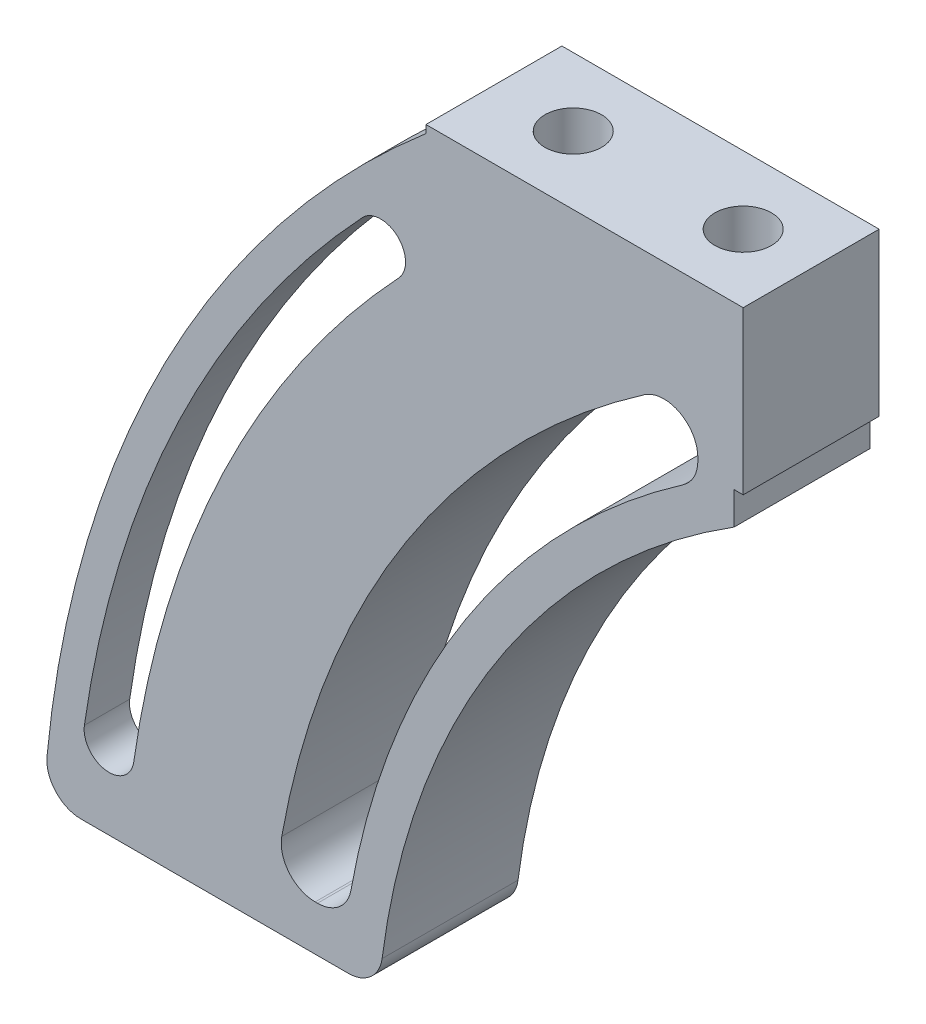
ISO-10303-21;
HEADER;
FILE_DESCRIPTION(('STEP AP214'),'2;1');
FILE_NAME('part.step','',(''),(''),'','','');
FILE_SCHEMA(('AUTOMOTIVE_DESIGN { 1 0 10303 214 1 1 1 1 }'));
ENDSEC;
DATA;
#1=APPLICATION_CONTEXT('core data for automotive mechanical design processes');
#2=APPLICATION_PROTOCOL_DEFINITION('international standard','automotive_design',2000,#1);
#3=PRODUCT_CONTEXT('',#1,'mechanical');
#4=PRODUCT('Part','Part','',(#3));
#5=PRODUCT_RELATED_PRODUCT_CATEGORY('part','',(#4));
#6=PRODUCT_DEFINITION_FORMATION('','',#4);
#7=PRODUCT_DEFINITION_CONTEXT('part definition',#1,'design');
#8=PRODUCT_DEFINITION('design','',#6,#7);
#9=PRODUCT_DEFINITION_SHAPE('','',#8);
#10=(LENGTH_UNIT() NAMED_UNIT(*) SI_UNIT(.MILLI.,.METRE.));
#11=(NAMED_UNIT(*) PLANE_ANGLE_UNIT() SI_UNIT($,.RADIAN.));
#12=(NAMED_UNIT(*) SI_UNIT($,.STERADIAN.) SOLID_ANGLE_UNIT());
#13=UNCERTAINTY_MEASURE_WITH_UNIT(LENGTH_MEASURE(1.E-05),#10,'distance_accuracy_value','');
#14=(GEOMETRIC_REPRESENTATION_CONTEXT(3) GLOBAL_UNCERTAINTY_ASSIGNED_CONTEXT((#13)) GLOBAL_UNIT_ASSIGNED_CONTEXT((#10,
#11,#12)) REPRESENTATION_CONTEXT('',''));
#15=CARTESIAN_POINT('',(0.,0.,0.));
#16=DIRECTION('',(0.,0.,1.));
#17=DIRECTION('',(1.,0.,0.));
#18=AXIS2_PLACEMENT_3D('',#15,#16,#17);
#19=CARTESIAN_POINT('',(-31.5,0.,-3.));
#20=DIRECTION('',(-1.,0.,0.));
#21=DIRECTION('',(0.,0.,1.));
#22=AXIS2_PLACEMENT_3D('',#19,#20,#21);
#23=PLANE('',#22);
#24=DIRECTION('',(0.,-1.,0.));
#25=VECTOR('',#24,1.);
#26=CARTESIAN_POINT('',(-31.5,0.,-3.));
#27=LINE('',#26,#25);
#28=CARTESIAN_POINT('',(-31.5,-2.5,-3.));
#29=VERTEX_POINT('',#28);
#30=CARTESIAN_POINT('',(-31.5,-12.4837006040881,-3.));
#31=VERTEX_POINT('',#30);
#32=EDGE_CURVE('E385',#29,#31,#27,.T.);
#33=ORIENTED_EDGE('',*,*,#32,.T.);
#34=DIRECTION('',(0.,0.,-1.));
#35=VECTOR('',#34,1.);
#36=CARTESIAN_POINT('',(-31.5,-12.4837006040881,1.));
#37=LINE('',#36,#35);
#38=CARTESIAN_POINT('',(-31.5,-12.4837006040881,1.));
#39=VERTEX_POINT('',#38);
#40=EDGE_CURVE('E501',#31,#39,#37,.F.);
#41=ORIENTED_EDGE('',*,*,#40,.T.);
#42=DIRECTION('',(0.,-1.,0.));
#43=VECTOR('',#42,1.);
#44=CARTESIAN_POINT('',(-31.5,-2.84659798601669,1.));
#45=LINE('',#44,#43);
#46=CARTESIAN_POINT('',(-31.5,-2.84659798601669,1.));
#47=VERTEX_POINT('',#46);
#48=EDGE_CURVE('E283',#47,#39,#45,.T.);
#49=ORIENTED_EDGE('',*,*,#48,.F.);
#50=DIRECTION('',(0.,0.,1.));
#51=VECTOR('',#50,1.);
#52=CARTESIAN_POINT('',(-31.5,-2.84659798601669,1.));
#53=LINE('',#52,#51);
#54=CARTESIAN_POINT('',(-31.5,-2.84659798601669,3.));
#55=VERTEX_POINT('',#54);
#56=EDGE_CURVE('E287',#47,#55,#53,.T.);
#57=ORIENTED_EDGE('',*,*,#56,.T.);
#58=DIRECTION('',(0.,-1.,0.));
#59=VECTOR('',#58,1.);
#60=CARTESIAN_POINT('',(-31.5,0.,3.));
#61=LINE('',#60,#59);
#62=CARTESIAN_POINT('',(-31.5,-2.5,3.));
#63=VERTEX_POINT('',#62);
#64=EDGE_CURVE('E350',#63,#55,#61,.T.);
#65=ORIENTED_EDGE('',*,*,#64,.F.);
#66=DIRECTION('',(0.,0.,1.));
#67=VECTOR('',#66,1.);
#68=CARTESIAN_POINT('',(-31.5,-2.5,-3.));
#69=LINE('',#68,#67);
#70=EDGE_CURVE('E407',#29,#63,#69,.T.);
#71=ORIENTED_EDGE('',*,*,#70,.F.);
#72=EDGE_LOOP('',(#33,#41,#49,#57,#65,#71));
#73=FACE_BOUND('',#72,.T.);
#74=ADVANCED_FACE('F45',(#73),#23,.T.);
#75=CARTESIAN_POINT('',(0.,-2.5,-3.));
#76=DIRECTION('',(0.,1.,0.));
#77=DIRECTION('',(0.,0.,1.));
#78=AXIS2_PLACEMENT_3D('',#75,#76,#77);
#79=PLANE('',#78);
#80=CARTESIAN_POINT('',(-20.5,-2.5,0.));
#81=DIRECTION('',(0.,1.,0.));
#82=DIRECTION('',(0.,0.,1.));
#83=AXIS2_PLACEMENT_3D('',#80,#81,#82);
#84=CIRCLE('',#83,1.24999999999999);
#85=CARTESIAN_POINT('',(-20.5,-2.5,1.24999999999998));
#86=VERTEX_POINT('',#85);
#87=EDGE_CURVE('E313',#86,#86,#84,.T.);
#88=ORIENTED_EDGE('',*,*,#87,.F.);
#89=EDGE_LOOP('',(#88));
#90=FACE_BOUND('',#89,.T.);
#91=CARTESIAN_POINT('',(-28.,-2.5,0.));
#92=DIRECTION('',(0.,1.,0.));
#93=DIRECTION('',(0.,0.,1.));
#94=AXIS2_PLACEMENT_3D('',#91,#92,#93);
#95=CIRCLE('',#94,1.24999999999999);
#96=CARTESIAN_POINT('',(-28.,-2.5,1.24999999999999));
#97=VERTEX_POINT('',#96);
#98=EDGE_CURVE('E326',#97,#97,#95,.T.);
#99=ORIENTED_EDGE('',*,*,#98,.F.);
#100=EDGE_LOOP('',(#99));
#101=FACE_BOUND('',#100,.T.);
#102=ORIENTED_EDGE('',*,*,#70,.T.);
#103=DIRECTION('',(-1.,0.,0.));
#104=VECTOR('',#103,1.);
#105=CARTESIAN_POINT('',(0.,-2.5,3.));
#106=LINE('',#105,#104);
#107=CARTESIAN_POINT('',(-17.5,-2.5,3.));
#108=VERTEX_POINT('',#107);
#109=EDGE_CURVE('E365',#108,#63,#106,.T.);
#110=ORIENTED_EDGE('',*,*,#109,.F.);
#111=DIRECTION('',(0.,0.,1.));
#112=VECTOR('',#111,1.);
#113=CARTESIAN_POINT('',(-17.5,-2.5,-3.));
#114=LINE('',#113,#112);
#115=CARTESIAN_POINT('',(-17.5,-2.5,-3.));
#116=VERTEX_POINT('',#115);
#117=EDGE_CURVE('E406',#116,#108,#114,.T.);
#118=ORIENTED_EDGE('',*,*,#117,.F.);
#119=DIRECTION('',(-1.,0.,0.));
#120=VECTOR('',#119,1.);
#121=CARTESIAN_POINT('',(0.,-2.5,-3.));
#122=LINE('',#121,#120);
#123=EDGE_CURVE('E402',#116,#29,#122,.T.);
#124=ORIENTED_EDGE('',*,*,#123,.T.);
#125=EDGE_LOOP('',(#102,#110,#118,#124));
#126=FACE_BOUND('',#125,.T.);
#127=ADVANCED_FACE('F555',(#90,#101,#126),#79,.T.);
#128=CARTESIAN_POINT('',(-17.5,0.,-3.));
#129=DIRECTION('',(-1.,0.,0.));
#130=DIRECTION('',(0.,0.,1.));
#131=AXIS2_PLACEMENT_3D('',#128,#129,#130);
#132=PLANE('',#131);
#133=DIRECTION('',(0.,-1.,0.));
#134=VECTOR('',#133,1.);
#135=CARTESIAN_POINT('',(-17.5,0.,3.));
#136=LINE('',#135,#134);
#137=CARTESIAN_POINT('',(-17.5,-9.65278175968161,3.));
#138=VERTEX_POINT('',#137);
#139=EDGE_CURVE('E361',#108,#138,#136,.T.);
#140=ORIENTED_EDGE('',*,*,#139,.T.);
#141=DIRECTION('',(0.,0.,1.));
#142=VECTOR('',#141,1.);
#143=CARTESIAN_POINT('',(-17.5,-9.65278175968161,-3.));
#144=LINE('',#143,#142);
#145=CARTESIAN_POINT('',(-17.5,-9.65278175968161,-3.));
#146=VERTEX_POINT('',#145);
#147=EDGE_CURVE('E303',#146,#138,#144,.T.);
#148=ORIENTED_EDGE('',*,*,#147,.F.);
#149=DIRECTION('',(0.,-1.,0.));
#150=VECTOR('',#149,1.);
#151=CARTESIAN_POINT('',(-17.5,0.,-3.));
#152=LINE('',#151,#150);
#153=EDGE_CURVE('E398',#116,#146,#152,.T.);
#154=ORIENTED_EDGE('',*,*,#153,.F.);
#155=ORIENTED_EDGE('',*,*,#117,.T.);
#156=EDGE_LOOP('',(#140,#148,#154,#155));
#157=FACE_BOUND('',#156,.T.);
#158=ADVANCED_FACE('F559',(#157),#132,.F.);
#159=CARTESIAN_POINT('',(0.,-39.6527817596816,-3.));
#160=DIRECTION('',(0.,0.,1.));
#161=DIRECTION('',(1.,0.,0.));
#162=AXIS2_PLACEMENT_3D('',#159,#160,#161);
#163=CYLINDRICAL_SURFACE('',#162,33.7120156620751);
#164=CARTESIAN_POINT('',(0.,-39.6527817596816,3.));
#165=DIRECTION('',(0.,0.,1.));
#166=DIRECTION('',(1.,0.,0.));
#167=AXIS2_PLACEMENT_3D('',#164,#165,#166);
#168=CIRCLE('',#167,33.7120156620751);
#169=CARTESIAN_POINT('',(-17.9,-11.0854927738503,3.));
#170=VERTEX_POINT('',#169);
#171=CARTESIAN_POINT('',(-33.4355875680168,-35.3444776871394,3.));
#172=VERTEX_POINT('',#171);
#173=EDGE_CURVE('E358',#170,#172,#168,.T.);
#174=ORIENTED_EDGE('',*,*,#173,.T.);
#175=DIRECTION('',(0.,0.,1.));
#176=VECTOR('',#175,1.);
#177=CARTESIAN_POINT('',(-33.4355875680168,-35.3444776871394,-3.));
#178=LINE('',#177,#176);
#179=CARTESIAN_POINT('',(-33.4355875680168,-35.3444776871394,-3.));
#180=VERTEX_POINT('',#179);
#181=EDGE_CURVE('E61',#172,#180,#178,.F.);
#182=ORIENTED_EDGE('',*,*,#181,.T.);
#183=CARTESIAN_POINT('',(0.,-39.6527817596816,-3.));
#184=DIRECTION('',(0.,0.,1.));
#185=DIRECTION('',(1.,0.,0.));
#186=AXIS2_PLACEMENT_3D('',#183,#184,#185);
#187=CIRCLE('',#186,33.7120156620751);
#188=CARTESIAN_POINT('',(-17.9,-11.0854927738503,-3.));
#189=VERTEX_POINT('',#188);
#190=EDGE_CURVE('E395',#189,#180,#187,.T.);
#191=ORIENTED_EDGE('',*,*,#190,.F.);
#192=DIRECTION('',(0.,0.,1.));
#193=VECTOR('',#192,1.);
#194=CARTESIAN_POINT('',(-17.9,-11.0854927738503,-3.));
#195=LINE('',#194,#193);
#196=EDGE_CURVE('E309',#189,#170,#195,.T.);
#197=ORIENTED_EDGE('',*,*,#196,.T.);
#198=EDGE_LOOP('',(#174,#182,#191,#197));
#199=FACE_BOUND('',#198,.T.);
#200=ADVANCED_FACE('F567',(#199),#163,.F.);
#201=CARTESIAN_POINT('',(0.,-36.6527817596816,-3.));
#202=DIRECTION('',(0.,1.,0.));
#203=DIRECTION('',(-1.,0.,0.));
#204=AXIS2_PLACEMENT_3D('',#201,#202,#203);
#205=PLANE('',#204);
#206=DIRECTION('',(-1.,0.,0.));
#207=VECTOR('',#206,1.);
#208=CARTESIAN_POINT('',(0.,-36.6527817596816,3.));
#209=LINE('',#208,#207);
#210=CARTESIAN_POINT('',(-34.9232880322891,-36.6527817596816,3.));
#211=VERTEX_POINT('',#210);
#212=CARTESIAN_POINT('',(-46.729105744497,-36.6527817596816,3.));
#213=VERTEX_POINT('',#212);
#214=EDGE_CURVE('E354',#211,#213,#209,.T.);
#215=ORIENTED_EDGE('',*,*,#214,.T.);
#216=DIRECTION('',(0.,0.,1.));
#217=VECTOR('',#216,1.);
#218=CARTESIAN_POINT('',(-46.729105744497,-36.6527817596816,-3.));
#219=LINE('',#218,#217);
#220=CARTESIAN_POINT('',(-46.729105744497,-36.6527817596816,1.));
#221=VERTEX_POINT('',#220);
#222=EDGE_CURVE('E492',#213,#221,#219,.F.);
#223=ORIENTED_EDGE('',*,*,#222,.T.);
#224=DIRECTION('',(-1.,0.,0.));
#225=VECTOR('',#224,1.);
#226=CARTESIAN_POINT('',(-41.1360320222893,-36.6527817596816,1.));
#227=LINE('',#226,#225);
#228=CARTESIAN_POINT('',(-39.4897111946694,-36.6527817596816,1.));
#229=VERTEX_POINT('',#228);
#230=EDGE_CURVE('E276',#229,#221,#227,.T.);
#231=ORIENTED_EDGE('',*,*,#230,.F.);
#232=DIRECTION('',(0.,0.,-1.));
#233=VECTOR('',#232,1.);
#234=CARTESIAN_POINT('',(-39.4897111946694,-36.6527817596816,-3.));
#235=LINE('',#234,#233);
#236=CARTESIAN_POINT('',(-39.4897111946694,-36.6527817596816,-3.));
#237=VERTEX_POINT('',#236);
#238=EDGE_CURVE('E485',#229,#237,#235,.T.);
#239=ORIENTED_EDGE('',*,*,#238,.T.);
#240=DIRECTION('',(-1.,0.,0.));
#241=VECTOR('',#240,1.);
#242=CARTESIAN_POINT('',(0.,-36.6527817596816,-3.));
#243=LINE('',#242,#241);
#244=CARTESIAN_POINT('',(-34.9232880322891,-36.6527817596816,-3.));
#245=VERTEX_POINT('',#244);
#246=EDGE_CURVE('E392',#245,#237,#243,.T.);
#247=ORIENTED_EDGE('',*,*,#246,.F.);
#248=DIRECTION('',(0.,0.,1.));
#249=VECTOR('',#248,1.);
#250=CARTESIAN_POINT('',(-34.9232880322891,-36.6527817596816,-3.));
#251=LINE('',#250,#249);
#252=EDGE_CURVE('E488',#245,#211,#251,.T.);
#253=ORIENTED_EDGE('',*,*,#252,.T.);
#254=EDGE_LOOP('',(#215,#223,#231,#239,#247,#253));
#255=FACE_BOUND('',#254,.T.);
#256=ADVANCED_FACE('F573',(#255),#205,.F.);
#257=CARTESIAN_POINT('',(-19.5,0.,-3.));
#258=DIRECTION('',(-1.,0.,0.));
#259=DIRECTION('',(0.,-1.,0.));
#260=AXIS2_PLACEMENT_3D('',#257,#258,#259);
#261=PLANE('',#260);
#262=DIRECTION('',(0.,-1.,0.));
#263=VECTOR('',#262,1.);
#264=CARTESIAN_POINT('',(-19.5,0.,-3.));
#265=LINE('',#264,#263);
#266=CARTESIAN_POINT('',(-19.5,-9.23535731012383,-3.));
#267=VERTEX_POINT('',#266);
#268=CARTESIAN_POINT('',(-19.5,-9.35695319764157,-3.));
#269=VERTEX_POINT('',#268);
#270=EDGE_CURVE('E369',#267,#269,#265,.T.);
#271=ORIENTED_EDGE('',*,*,#270,.T.);
#272=DIRECTION('',(0.,0.,-1.));
#273=VECTOR('',#272,1.);
#274=CARTESIAN_POINT('',(-19.5,-9.35695319764157,3.));
#275=LINE('',#274,#273);
#276=CARTESIAN_POINT('',(-19.5,-9.35695319764157,3.));
#277=VERTEX_POINT('',#276);
#278=EDGE_CURVE('E436',#269,#277,#275,.F.);
#279=ORIENTED_EDGE('',*,*,#278,.T.);
#280=DIRECTION('',(0.,-1.,0.));
#281=VECTOR('',#280,1.);
#282=CARTESIAN_POINT('',(-19.5,0.,3.));
#283=LINE('',#282,#281);
#284=CARTESIAN_POINT('',(-19.5,-9.23535731012383,3.));
#285=VERTEX_POINT('',#284);
#286=EDGE_CURVE('E334',#285,#277,#283,.T.);
#287=ORIENTED_EDGE('',*,*,#286,.F.);
#288=DIRECTION('',(0.,0.,1.));
#289=VECTOR('',#288,1.);
#290=CARTESIAN_POINT('',(-19.5,-9.23535731012383,-3.));
#291=LINE('',#290,#289);
#292=EDGE_CURVE('E433',#285,#267,#291,.F.);
#293=ORIENTED_EDGE('',*,*,#292,.T.);
#294=EDGE_LOOP('',(#271,#279,#287,#293));
#295=FACE_BOUND('',#294,.T.);
#296=ADVANCED_FACE('F575',(#295),#261,.T.);
#297=CARTESIAN_POINT('',(0.,-39.6527817596816,-3.));
#298=DIRECTION('',(0.,0.,1.));
#299=DIRECTION('',(1.,0.,0.));
#300=AXIS2_PLACEMENT_3D('',#297,#298,#299);
#301=CYLINDRICAL_SURFACE('',#300,38.4624094201738);
#302=CARTESIAN_POINT('',(0.,-39.6527817596816,3.));
#303=DIRECTION('',(0.,0.,1.));
#304=DIRECTION('',(1.,0.,0.));
#305=AXIS2_PLACEMENT_3D('',#302,#303,#304);
#306=CIRCLE('',#305,38.4624094201738);
#307=CARTESIAN_POINT('',(-21.8522171712867,-8.00096438525584,3.));
#308=VERTEX_POINT('',#307);
#309=CARTESIAN_POINT('',(-37.8630188726719,-32.8890002542834,3.));
#310=VERTEX_POINT('',#309);
#311=EDGE_CURVE('E346',#308,#310,#306,.T.);
#312=ORIENTED_EDGE('',*,*,#311,.T.);
#313=DIRECTION('',(0.,0.,1.));
#314=VECTOR('',#313,1.);
#315=CARTESIAN_POINT('',(-37.8630188726719,-32.8890002542834,-3.));
#316=LINE('',#315,#314);
#317=CARTESIAN_POINT('',(-37.8630188726719,-32.8890002542834,-3.));
#318=VERTEX_POINT('',#317);
#319=EDGE_CURVE('E423',#310,#318,#316,.F.);
#320=ORIENTED_EDGE('',*,*,#319,.T.);
#321=CARTESIAN_POINT('',(0.,-39.6527817596816,-3.));
#322=DIRECTION('',(0.,0.,1.));
#323=DIRECTION('',(1.,0.,0.));
#324=AXIS2_PLACEMENT_3D('',#321,#322,#323);
#325=CIRCLE('',#324,38.4624094201738);
#326=CARTESIAN_POINT('',(-21.8522171712867,-8.00096438525584,-3.));
#327=VERTEX_POINT('',#326);
#328=EDGE_CURVE('E381',#327,#318,#325,.T.);
#329=ORIENTED_EDGE('',*,*,#328,.F.);
#330=DIRECTION('',(0.,0.,1.));
#331=VECTOR('',#330,1.);
#332=CARTESIAN_POINT('',(-21.8522171712867,-8.00096438525583,-3.));
#333=LINE('',#332,#331);
#334=EDGE_CURVE('E419',#327,#308,#333,.T.);
#335=ORIENTED_EDGE('',*,*,#334,.T.);
#336=EDGE_LOOP('',(#312,#320,#329,#335));
#337=FACE_BOUND('',#336,.T.);
#338=ADVANCED_FACE('F581',(#337),#301,.F.);
#339=CARTESIAN_POINT('',(0.,-34.6527817596816,-3.));
#340=DIRECTION('',(0.,-1.,0.));
#341=DIRECTION('',(0.,0.,-1.));
#342=AXIS2_PLACEMENT_3D('',#339,#340,#341);
#343=PLANE('',#342);
#344=DIRECTION('',(1.,0.,0.));
#345=VECTOR('',#344,1.);
#346=CARTESIAN_POINT('',(0.,-34.6527817596816,-3.));
#347=LINE('',#346,#345);
#348=CARTESIAN_POINT('',(-36.3863945746835,-34.6527817596816,-3.));
#349=VERTEX_POINT('',#348);
#350=CARTESIAN_POINT('',(-36.2848071272333,-34.6527817596816,-3.));
#351=VERTEX_POINT('',#350);
#352=EDGE_CURVE('E377',#349,#351,#347,.T.);
#353=ORIENTED_EDGE('',*,*,#352,.F.);
#354=DIRECTION('',(0.,0.,-1.));
#355=VECTOR('',#354,1.);
#356=CARTESIAN_POINT('',(-36.3863945746835,-34.6527817596816,3.));
#357=LINE('',#356,#355);
#358=CARTESIAN_POINT('',(-36.3863945746835,-34.6527817596816,3.));
#359=VERTEX_POINT('',#358);
#360=EDGE_CURVE('E415',#349,#359,#357,.F.);
#361=ORIENTED_EDGE('',*,*,#360,.T.);
#362=DIRECTION('',(1.,0.,0.));
#363=VECTOR('',#362,1.);
#364=CARTESIAN_POINT('',(0.,-34.6527817596816,3.));
#365=LINE('',#364,#363);
#366=CARTESIAN_POINT('',(-36.2848071272333,-34.6527817596816,3.));
#367=VERTEX_POINT('',#366);
#368=EDGE_CURVE('E342',#359,#367,#365,.T.);
#369=ORIENTED_EDGE('',*,*,#368,.T.);
#370=DIRECTION('',(0.,0.,1.));
#371=VECTOR('',#370,1.);
#372=CARTESIAN_POINT('',(-36.2848071272333,-34.6527817596816,-3.));
#373=LINE('',#372,#371);
#374=EDGE_CURVE('E410',#367,#351,#373,.F.);
#375=ORIENTED_EDGE('',*,*,#374,.T.);
#376=EDGE_LOOP('',(#353,#361,#369,#375));
#377=FACE_BOUND('',#376,.T.);
#378=ADVANCED_FACE('F596',(#377),#343,.F.);
#379=CARTESIAN_POINT('',(0.,-39.6527817596816,-3.));
#380=DIRECTION('',(0.,0.,1.));
#381=DIRECTION('',(1.,0.,0.));
#382=AXIS2_PLACEMENT_3D('',#379,#380,#381);
#383=CYLINDRICAL_SURFACE('',#382,35.3624094201739);
#384=CARTESIAN_POINT('',(0.,-39.6527817596816,-3.));
#385=DIRECTION('',(0.,0.,1.));
#386=DIRECTION('',(1.,0.,0.));
#387=AXIS2_PLACEMENT_3D('',#384,#385,#386);
#388=CIRCLE('',#387,35.3624094201739);
#389=CARTESIAN_POINT('',(-20.1454709419303,-10.5897468092873,-3.));
#390=VERTEX_POINT('',#389);
#391=CARTESIAN_POINT('',(-34.8083108388202,-33.4172788490841,-3.));
#392=VERTEX_POINT('',#391);
#393=EDGE_CURVE('E373',#390,#392,#388,.T.);
#394=ORIENTED_EDGE('',*,*,#393,.T.);
#395=DIRECTION('',(0.,0.,1.));
#396=VECTOR('',#395,1.);
#397=CARTESIAN_POINT('',(-34.8083108388202,-33.4172788490841,-3.));
#398=LINE('',#397,#396);
#399=CARTESIAN_POINT('',(-34.8083108388202,-33.4172788490841,3.));
#400=VERTEX_POINT('',#399);
#401=EDGE_CURVE('E429',#392,#400,#398,.T.);
#402=ORIENTED_EDGE('',*,*,#401,.T.);
#403=CARTESIAN_POINT('',(0.,-39.6527817596816,3.));
#404=DIRECTION('',(0.,0.,1.));
#405=DIRECTION('',(1.,0.,0.));
#406=AXIS2_PLACEMENT_3D('',#403,#404,#405);
#407=CIRCLE('',#406,35.3624094201739);
#408=CARTESIAN_POINT('',(-20.1454709419303,-10.5897468092873,3.));
#409=VERTEX_POINT('',#408);
#410=EDGE_CURVE('E338',#409,#400,#407,.T.);
#411=ORIENTED_EDGE('',*,*,#410,.F.);
#412=DIRECTION('',(0.,0.,1.));
#413=VECTOR('',#412,1.);
#414=CARTESIAN_POINT('',(-20.1454709419303,-10.5897468092873,-3.));
#415=LINE('',#414,#413);
#416=EDGE_CURVE('E426',#409,#390,#415,.F.);
#417=ORIENTED_EDGE('',*,*,#416,.T.);
#418=EDGE_LOOP('',(#394,#402,#411,#417));
#419=FACE_BOUND('',#418,.T.);
#420=ADVANCED_FACE('F600',(#419),#383,.T.);
#421=CARTESIAN_POINT('',(0.,-39.6527817596816,-3.));
#422=DIRECTION('',(0.,0.,1.));
#423=DIRECTION('',(1.,0.,0.));
#424=AXIS2_PLACEMENT_3D('',#421,#422,#423);
#425=CYLINDRICAL_SURFACE('',#424,41.2452801001377);
#426=CARTESIAN_POINT('',(0.,-39.6527817596816,1.));
#427=DIRECTION('',(0.,0.,1.));
#428=DIRECTION('',(-1.,0.,0.));
#429=AXIS2_PLACEMENT_3D('',#426,#427,#428);
#430=CIRCLE('',#429,41.2452801001377);
#431=CARTESIAN_POINT('',(-31.8419774093412,-13.437106960016,1.));
#432=VERTEX_POINT('',#431);
#433=CARTESIAN_POINT('',(-40.9800659397552,-34.9829502732009,1.));
#434=VERTEX_POINT('',#433);
#435=EDGE_CURVE('E272',#432,#434,#430,.T.);
#436=ORIENTED_EDGE('',*,*,#435,.F.);
#437=DIRECTION('',(0.,0.,1.));
#438=VECTOR('',#437,1.);
#439=CARTESIAN_POINT('',(-31.8419774093412,-13.437106960016,-3.));
#440=LINE('',#439,#438);
#441=CARTESIAN_POINT('',(-31.8419774093412,-13.437106960016,-3.));
#442=VERTEX_POINT('',#441);
#443=EDGE_CURVE('E509',#432,#442,#440,.F.);
#444=ORIENTED_EDGE('',*,*,#443,.T.);
#445=CARTESIAN_POINT('',(0.,-39.6527817596816,-3.));
#446=DIRECTION('',(0.,0.,1.));
#447=DIRECTION('',(1.,0.,0.));
#448=AXIS2_PLACEMENT_3D('',#445,#446,#447);
#449=CIRCLE('',#448,41.2452801001377);
#450=CARTESIAN_POINT('',(-40.9800659397552,-34.9829502732009,-3.));
#451=VERTEX_POINT('',#450);
#452=EDGE_CURVE('E389',#442,#451,#449,.T.);
#453=ORIENTED_EDGE('',*,*,#452,.T.);
#454=DIRECTION('',(0.,0.,1.));
#455=VECTOR('',#454,1.);
#456=CARTESIAN_POINT('',(-40.9800659397552,-34.9829502732009,-3.));
#457=LINE('',#456,#455);
#458=EDGE_CURVE('E505',#451,#434,#457,.T.);
#459=ORIENTED_EDGE('',*,*,#458,.T.);
#460=EDGE_LOOP('',(#436,#444,#453,#459));
#461=FACE_BOUND('',#460,.T.);
#462=ADVANCED_FACE('F534',(#461),#425,.T.);
#463=CARTESIAN_POINT('',(0.,0.,-3.));
#464=DIRECTION('',(0.,0.,1.));
#465=DIRECTION('',(1.,0.,0.));
#466=AXIS2_PLACEMENT_3D('',#463,#464,#465);
#467=PLANE('',#466);
#468=ORIENTED_EDGE('',*,*,#270,.F.);
#469=CARTESIAN_POINT('',(-21.,-9.23535731012383,-3.));
#470=DIRECTION('',(0.,0.,1.));
#471=DIRECTION('',(1.,0.,0.));
#472=AXIS2_PLACEMENT_3D('',#469,#470,#471);
#473=CIRCLE('',#472,1.5);
#474=EDGE_CURVE('E461',#267,#327,#473,.T.);
#475=ORIENTED_EDGE('',*,*,#474,.T.);
#476=ORIENTED_EDGE('',*,*,#328,.T.);
#477=CARTESIAN_POINT('',(-36.3863945746835,-33.1527817596816,-3.));
#478=DIRECTION('',(0.,0.,1.));
#479=DIRECTION('',(1.,0.,0.));
#480=AXIS2_PLACEMENT_3D('',#477,#478,#479);
#481=CIRCLE('',#480,1.5);
#482=EDGE_CURVE('E443',#318,#349,#481,.T.);
#483=ORIENTED_EDGE('',*,*,#482,.T.);
#484=ORIENTED_EDGE('',*,*,#352,.T.);
#485=CARTESIAN_POINT('',(-36.2848071272333,-33.1527817596816,-3.));
#486=DIRECTION('',(0.,0.,1.));
#487=DIRECTION('',(1.,0.,0.));
#488=AXIS2_PLACEMENT_3D('',#485,#486,#487);
#489=CIRCLE('',#488,1.5);
#490=EDGE_CURVE('E449',#351,#392,#489,.T.);
#491=ORIENTED_EDGE('',*,*,#490,.T.);
#492=ORIENTED_EDGE('',*,*,#393,.F.);
#493=CARTESIAN_POINT('',(-21.,-9.35695319764157,-3.));
#494=DIRECTION('',(0.,0.,1.));
#495=DIRECTION('',(1.,0.,0.));
#496=AXIS2_PLACEMENT_3D('',#493,#494,#495);
#497=CIRCLE('',#496,1.5);
#498=EDGE_CURVE('E455',#390,#269,#497,.T.);
#499=ORIENTED_EDGE('',*,*,#498,.T.);
#500=EDGE_LOOP('',(#468,#475,#476,#483,#484,#491,#492,#499));
#501=FACE_BOUND('',#500,.T.);
#502=ORIENTED_EDGE('',*,*,#190,.T.);
#503=CARTESIAN_POINT('',(-34.9232880322891,-35.1527817596816,-3.));
#504=DIRECTION('',(0.,0.,1.));
#505=DIRECTION('',(1.,0.,0.));
#506=AXIS2_PLACEMENT_3D('',#503,#504,#505);
#507=CIRCLE('',#506,1.5);
#508=EDGE_CURVE('E516',#180,#245,#507,.F.);
#509=ORIENTED_EDGE('',*,*,#508,.T.);
#510=ORIENTED_EDGE('',*,*,#246,.T.);
#511=CARTESIAN_POINT('',(-39.4897111946694,-35.1527817596816,-3.));
#512=DIRECTION('',(0.,0.,1.));
#513=DIRECTION('',(1.,0.,0.));
#514=AXIS2_PLACEMENT_3D('',#511,#512,#513);
#515=CIRCLE('',#514,1.5);
#516=EDGE_CURVE('E69',#237,#451,#515,.F.);
#517=ORIENTED_EDGE('',*,*,#516,.T.);
#518=ORIENTED_EDGE('',*,*,#452,.F.);
#519=CARTESIAN_POINT('',(-33.,-12.4837006040881,-3.));
#520=DIRECTION('',(0.,0.,1.));
#521=DIRECTION('',(1.,0.,0.));
#522=AXIS2_PLACEMENT_3D('',#519,#520,#521);
#523=CIRCLE('',#522,1.5);
#524=EDGE_CURVE('E54',#442,#31,#523,.T.);
#525=ORIENTED_EDGE('',*,*,#524,.T.);
#526=ORIENTED_EDGE('',*,*,#32,.F.);
#527=ORIENTED_EDGE('',*,*,#123,.F.);
#528=ORIENTED_EDGE('',*,*,#153,.T.);
#529=DIRECTION('',(-1.,0.,0.));
#530=VECTOR('',#529,1.);
#531=CARTESIAN_POINT('',(-17.5,-9.65278175968161,-3.));
#532=LINE('',#531,#530);
#533=CARTESIAN_POINT('',(-17.9,-9.65278175968161,-3.));
#534=VERTEX_POINT('',#533);
#535=EDGE_CURVE('E294',#146,#534,#532,.T.);
#536=ORIENTED_EDGE('',*,*,#535,.T.);
#537=DIRECTION('',(0.,-1.,0.));
#538=VECTOR('',#537,1.);
#539=CARTESIAN_POINT('',(-17.9,-11.0854927738503,-3.));
#540=LINE('',#539,#538);
#541=EDGE_CURVE('E298',#534,#189,#540,.T.);
#542=ORIENTED_EDGE('',*,*,#541,.T.);
#543=EDGE_LOOP('',(#502,#509,#510,#517,#518,#525,#526,#527,#528,#536,#542));
#544=FACE_BOUND('',#543,.T.);
#545=ADVANCED_FACE('F521',(#501,#544),#467,.F.);
#546=CARTESIAN_POINT('',(0.,0.,3.));
#547=DIRECTION('',(0.,0.,1.));
#548=DIRECTION('',(1.,0.,0.));
#549=AXIS2_PLACEMENT_3D('',#546,#547,#548);
#550=PLANE('',#549);
#551=CARTESIAN_POINT('',(-33.5,-8.20888309109875,3.));
#552=DIRECTION('',(0.,0.,1.));
#553=DIRECTION('',(1.,0.,0.));
#554=AXIS2_PLACEMENT_3D('',#551,#552,#553);
#555=CIRCLE('',#554,1.1);
#556=CARTESIAN_POINT('',(-32.6979589651062,-8.96169792779266,3.));
#557=VERTEX_POINT('',#556);
#558=CARTESIAN_POINT('',(-34.3020410348938,-7.45606825440483,3.));
#559=VERTEX_POINT('',#558);
#560=EDGE_CURVE('E252',#557,#559,#555,.T.);
#561=ORIENTED_EDGE('',*,*,#560,.F.);
#562=CARTESIAN_POINT('',(0.,-39.6527817596816,3.));
#563=DIRECTION('',(0.,0.,-1.));
#564=DIRECTION('',(1.,0.,0.));
#565=AXIS2_PLACEMENT_3D('',#562,#563,#564);
#566=CIRCLE('',#565,44.8452801001377);
#567=CARTESIAN_POINT('',(-44.3942337295692,-33.3084016619745,3.));
#568=VERTEX_POINT('',#567);
#569=EDGE_CURVE('E257',#568,#557,#566,.T.);
#570=ORIENTED_EDGE('',*,*,#569,.F.);
#571=CARTESIAN_POINT('',(-45.4831701124725,-33.1527817596816,3.));
#572=DIRECTION('',(0.,0.,1.));
#573=DIRECTION('',(1.,0.,0.));
#574=AXIS2_PLACEMENT_3D('',#571,#572,#573);
#575=CIRCLE('',#574,1.1);
#576=CARTESIAN_POINT('',(-46.5721064953757,-32.9971618573888,3.));
#577=VERTEX_POINT('',#576);
#578=EDGE_CURVE('E234',#577,#568,#575,.T.);
#579=ORIENTED_EDGE('',*,*,#578,.F.);
#580=CARTESIAN_POINT('',(0.,-39.6527817596816,3.));
#581=DIRECTION('',(0.,0.,1.));
#582=DIRECTION('',(1.,0.,0.));
#583=AXIS2_PLACEMENT_3D('',#580,#581,#582);
#584=CIRCLE('',#583,47.0452801001377);
#585=EDGE_CURVE('E246',#559,#577,#584,.T.);
#586=ORIENTED_EDGE('',*,*,#585,.F.);
#587=EDGE_LOOP('',(#561,#570,#579,#586));
#588=FACE_BOUND('',#587,.T.);
#589=CARTESIAN_POINT('',(0.,-39.6527817596816,3.));
#590=DIRECTION('',(0.,0.,-1.));
#591=DIRECTION('',(-1.,0.,0.));
#592=AXIS2_PLACEMENT_3D('',#589,#590,#591);
#593=CIRCLE('',#592,48.4452801001377);
#594=CARTESIAN_POINT('',(-48.2221985211772,-35.0089973369324,3.));
#595=VERTEX_POINT('',#594);
#596=EDGE_CURVE('E267',#595,#55,#593,.T.);
#597=ORIENTED_EDGE('',*,*,#596,.F.);
#598=CARTESIAN_POINT('',(-46.729105744497,-35.1527817596816,3.));
#599=DIRECTION('',(0.,0.,1.));
#600=DIRECTION('',(1.,0.,0.));
#601=AXIS2_PLACEMENT_3D('',#598,#599,#600);
#602=CIRCLE('',#601,1.5);
#603=EDGE_CURVE('E482',#595,#213,#602,.T.);
#604=ORIENTED_EDGE('',*,*,#603,.T.);
#605=ORIENTED_EDGE('',*,*,#214,.F.);
#606=CARTESIAN_POINT('',(-34.9232880322891,-35.1527817596816,3.));
#607=DIRECTION('',(0.,0.,1.));
#608=DIRECTION('',(1.,0.,0.));
#609=AXIS2_PLACEMENT_3D('',#606,#607,#608);
#610=CIRCLE('',#609,1.5);
#611=EDGE_CURVE('E479',#211,#172,#610,.T.);
#612=ORIENTED_EDGE('',*,*,#611,.T.);
#613=ORIENTED_EDGE('',*,*,#173,.F.);
#614=DIRECTION('',(0.,-1.,0.));
#615=VECTOR('',#614,1.);
#616=CARTESIAN_POINT('',(-17.9,-11.0854927738503,3.));
#617=LINE('',#616,#615);
#618=CARTESIAN_POINT('',(-17.9,-9.65278175968161,3.));
#619=VERTEX_POINT('',#618);
#620=EDGE_CURVE('E299',#619,#170,#617,.T.);
#621=ORIENTED_EDGE('',*,*,#620,.F.);
#622=DIRECTION('',(-1.,0.,0.));
#623=VECTOR('',#622,1.);
#624=CARTESIAN_POINT('',(-17.5,-9.65278175968161,3.));
#625=LINE('',#624,#623);
#626=EDGE_CURVE('E293',#138,#619,#625,.T.);
#627=ORIENTED_EDGE('',*,*,#626,.F.);
#628=ORIENTED_EDGE('',*,*,#139,.F.);
#629=ORIENTED_EDGE('',*,*,#109,.T.);
#630=ORIENTED_EDGE('',*,*,#64,.T.);
#631=EDGE_LOOP('',(#597,#604,#605,#612,#613,#621,#627,#628,#629,#630));
#632=FACE_BOUND('',#631,.T.);
#633=ORIENTED_EDGE('',*,*,#311,.F.);
#634=CARTESIAN_POINT('',(-21.,-9.23535731012383,3.));
#635=DIRECTION('',(0.,0.,1.));
#636=DIRECTION('',(1.,0.,0.));
#637=AXIS2_PLACEMENT_3D('',#634,#635,#636);
#638=CIRCLE('',#637,1.5);
#639=EDGE_CURVE('E458',#308,#285,#638,.F.);
#640=ORIENTED_EDGE('',*,*,#639,.T.);
#641=ORIENTED_EDGE('',*,*,#286,.T.);
#642=CARTESIAN_POINT('',(-21.,-9.35695319764157,3.));
#643=DIRECTION('',(0.,0.,1.));
#644=DIRECTION('',(1.,0.,0.));
#645=AXIS2_PLACEMENT_3D('',#642,#643,#644);
#646=CIRCLE('',#645,1.5);
#647=EDGE_CURVE('E452',#277,#409,#646,.F.);
#648=ORIENTED_EDGE('',*,*,#647,.T.);
#649=ORIENTED_EDGE('',*,*,#410,.T.);
#650=CARTESIAN_POINT('',(-36.2848071272333,-33.1527817596816,3.));
#651=DIRECTION('',(0.,0.,1.));
#652=DIRECTION('',(1.,0.,0.));
#653=AXIS2_PLACEMENT_3D('',#650,#651,#652);
#654=CIRCLE('',#653,1.5);
#655=EDGE_CURVE('E446',#400,#367,#654,.F.);
#656=ORIENTED_EDGE('',*,*,#655,.T.);
#657=ORIENTED_EDGE('',*,*,#368,.F.);
#658=CARTESIAN_POINT('',(-36.3863945746835,-33.1527817596816,3.));
#659=DIRECTION('',(0.,0.,1.));
#660=DIRECTION('',(1.,0.,0.));
#661=AXIS2_PLACEMENT_3D('',#658,#659,#660);
#662=CIRCLE('',#661,1.5);
#663=EDGE_CURVE('E440',#359,#310,#662,.F.);
#664=ORIENTED_EDGE('',*,*,#663,.T.);
#665=EDGE_LOOP('',(#633,#640,#641,#648,#649,#656,#657,#664));
#666=FACE_BOUND('',#665,.T.);
#667=ADVANCED_FACE('F254',(#588,#632,#666),#550,.T.);
#668=CARTESIAN_POINT('',(-28.,-5.74892422621555,0.));
#669=DIRECTION('',(0.,1.,0.));
#670=DIRECTION('',(0.,0.,1.));
#671=AXIS2_PLACEMENT_3D('',#668,#669,#670);
#672=CONICAL_SURFACE('',#671,1.25,1.02974425867665);
#673=CARTESIAN_POINT('',(-28.,-6.5,0.));
#674=VERTEX_POINT('',#673);
#675=VERTEX_LOOP('',#674);
#676=FACE_BOUND('',#675,.T.);
#677=CARTESIAN_POINT('',(-28.,-5.74892422621555,0.));
#678=DIRECTION('',(0.,1.,0.));
#679=DIRECTION('',(0.,0.,1.));
#680=AXIS2_PLACEMENT_3D('',#677,#678,#679);
#681=CIRCLE('',#680,1.25);
#682=CARTESIAN_POINT('',(-28.,-5.74892422621555,1.25));
#683=VERTEX_POINT('',#682);
#684=EDGE_CURVE('E330',#683,#683,#681,.T.);
#685=ORIENTED_EDGE('',*,*,#684,.T.);
#686=EDGE_LOOP('',(#685));
#687=FACE_BOUND('',#686,.T.);
#688=ADVANCED_FACE('F680',(#676,#687),#672,.F.);
#689=CARTESIAN_POINT('',(-28.,-2.5,0.));
#690=DIRECTION('',(0.,1.,0.));
#691=DIRECTION('',(0.,0.,1.));
#692=AXIS2_PLACEMENT_3D('',#689,#690,#691);
#693=CYLINDRICAL_SURFACE('',#692,1.24999999999999);
#694=ORIENTED_EDGE('',*,*,#684,.F.);
#695=EDGE_LOOP('',(#694));
#696=FACE_BOUND('',#695,.T.);
#697=ORIENTED_EDGE('',*,*,#98,.T.);
#698=EDGE_LOOP('',(#697));
#699=FACE_BOUND('',#698,.T.);
#700=ADVANCED_FACE('F839',(#696,#699),#693,.F.);
#701=CARTESIAN_POINT('',(-20.5,-5.74892422621555,0.));
#702=DIRECTION('',(0.,1.,0.));
#703=DIRECTION('',(0.,0.,1.));
#704=AXIS2_PLACEMENT_3D('',#701,#702,#703);
#705=CONICAL_SURFACE('',#704,1.25,1.02974425867665);
#706=CARTESIAN_POINT('',(-20.5,-6.5,0.));
#707=VERTEX_POINT('',#706);
#708=VERTEX_LOOP('',#707);
#709=FACE_BOUND('',#708,.T.);
#710=CARTESIAN_POINT('',(-20.5,-5.74892422621555,0.));
#711=DIRECTION('',(0.,1.,0.));
#712=DIRECTION('',(0.,0.,1.));
#713=AXIS2_PLACEMENT_3D('',#710,#711,#712);
#714=CIRCLE('',#713,1.25);
#715=CARTESIAN_POINT('',(-20.5,-5.74892422621555,1.25));
#716=VERTEX_POINT('',#715);
#717=EDGE_CURVE('E322',#716,#716,#714,.T.);
#718=ORIENTED_EDGE('',*,*,#717,.T.);
#719=EDGE_LOOP('',(#718));
#720=FACE_BOUND('',#719,.T.);
#721=ADVANCED_FACE('F827',(#709,#720),#705,.F.);
#722=CARTESIAN_POINT('',(-20.5,-2.5,0.));
#723=DIRECTION('',(0.,1.,0.));
#724=DIRECTION('',(0.,0.,1.));
#725=AXIS2_PLACEMENT_3D('',#722,#723,#724);
#726=CYLINDRICAL_SURFACE('',#725,1.24999999999999);
#727=ORIENTED_EDGE('',*,*,#717,.F.);
#728=EDGE_LOOP('',(#727));
#729=FACE_BOUND('',#728,.T.);
#730=ORIENTED_EDGE('',*,*,#87,.T.);
#731=EDGE_LOOP('',(#730));
#732=FACE_BOUND('',#731,.T.);
#733=ADVANCED_FACE('F609',(#729,#732),#726,.F.);
#734=CARTESIAN_POINT('',(-36.3863945746835,-33.1527817596816,-3.));
#735=DIRECTION('',(0.,0.,1.));
#736=DIRECTION('',(1.,0.,0.));
#737=AXIS2_PLACEMENT_3D('',#734,#735,#736);
#738=CYLINDRICAL_SURFACE('',#737,1.5);
#739=ORIENTED_EDGE('',*,*,#482,.F.);
#740=ORIENTED_EDGE('',*,*,#319,.F.);
#741=ORIENTED_EDGE('',*,*,#663,.F.);
#742=ORIENTED_EDGE('',*,*,#360,.F.);
#743=EDGE_LOOP('',(#739,#740,#741,#742));
#744=FACE_BOUND('',#743,.T.);
#745=ADVANCED_FACE('F605',(#744),#738,.F.);
#746=CARTESIAN_POINT('',(-36.2848071272333,-33.1527817596816,-3.));
#747=DIRECTION('',(0.,0.,1.));
#748=DIRECTION('',(1.,0.,0.));
#749=AXIS2_PLACEMENT_3D('',#746,#747,#748);
#750=CYLINDRICAL_SURFACE('',#749,1.5);
#751=ORIENTED_EDGE('',*,*,#490,.F.);
#752=ORIENTED_EDGE('',*,*,#374,.F.);
#753=ORIENTED_EDGE('',*,*,#655,.F.);
#754=ORIENTED_EDGE('',*,*,#401,.F.);
#755=EDGE_LOOP('',(#751,#752,#753,#754));
#756=FACE_BOUND('',#755,.T.);
#757=ADVANCED_FACE('F608',(#756),#750,.F.);
#758=CARTESIAN_POINT('',(-21.,-9.35695319764157,-3.));
#759=DIRECTION('',(0.,0.,1.));
#760=DIRECTION('',(1.,0.,0.));
#761=AXIS2_PLACEMENT_3D('',#758,#759,#760);
#762=CYLINDRICAL_SURFACE('',#761,1.5);
#763=ORIENTED_EDGE('',*,*,#498,.F.);
#764=ORIENTED_EDGE('',*,*,#416,.F.);
#765=ORIENTED_EDGE('',*,*,#647,.F.);
#766=ORIENTED_EDGE('',*,*,#278,.F.);
#767=EDGE_LOOP('',(#763,#764,#765,#766));
#768=FACE_BOUND('',#767,.T.);
#769=ADVANCED_FACE('F613',(#768),#762,.F.);
#770=CARTESIAN_POINT('',(-21.,-9.23535731012383,-3.));
#771=DIRECTION('',(0.,0.,1.));
#772=DIRECTION('',(1.,0.,0.));
#773=AXIS2_PLACEMENT_3D('',#770,#771,#772);
#774=CYLINDRICAL_SURFACE('',#773,1.5);
#775=ORIENTED_EDGE('',*,*,#474,.F.);
#776=ORIENTED_EDGE('',*,*,#292,.F.);
#777=ORIENTED_EDGE('',*,*,#639,.F.);
#778=ORIENTED_EDGE('',*,*,#334,.F.);
#779=EDGE_LOOP('',(#775,#776,#777,#778));
#780=FACE_BOUND('',#779,.T.);
#781=ADVANCED_FACE('F617',(#780),#774,.F.);
#782=CARTESIAN_POINT('',(-17.9,-11.0854927738503,-3.));
#783=DIRECTION('',(-1.,0.,0.));
#784=DIRECTION('',(0.,0.,1.));
#785=AXIS2_PLACEMENT_3D('',#782,#783,#784);
#786=PLANE('',#785);
#787=ORIENTED_EDGE('',*,*,#620,.T.);
#788=ORIENTED_EDGE('',*,*,#196,.F.);
#789=ORIENTED_EDGE('',*,*,#541,.F.);
#790=DIRECTION('',(0.,0.,1.));
#791=VECTOR('',#790,1.);
#792=CARTESIAN_POINT('',(-17.9,-9.65278175968161,-3.));
#793=LINE('',#792,#791);
#794=EDGE_CURVE('E314',#534,#619,#793,.T.);
#795=ORIENTED_EDGE('',*,*,#794,.T.);
#796=EDGE_LOOP('',(#787,#788,#789,#795));
#797=FACE_BOUND('',#796,.T.);
#798=ADVANCED_FACE('F565',(#797),#786,.F.);
#799=CARTESIAN_POINT('',(-17.5,-9.65278175968161,-3.));
#800=DIRECTION('',(0.,1.,0.));
#801=DIRECTION('',(0.,0.,1.));
#802=AXIS2_PLACEMENT_3D('',#799,#800,#801);
#803=PLANE('',#802);
#804=ORIENTED_EDGE('',*,*,#626,.T.);
#805=ORIENTED_EDGE('',*,*,#794,.F.);
#806=ORIENTED_EDGE('',*,*,#535,.F.);
#807=ORIENTED_EDGE('',*,*,#147,.T.);
#808=EDGE_LOOP('',(#804,#805,#806,#807));
#809=FACE_BOUND('',#808,.T.);
#810=ADVANCED_FACE('F561',(#809),#803,.F.);
#811=CARTESIAN_POINT('',(0.,-39.6527817596816,1.));
#812=DIRECTION('',(0.,0.,1.));
#813=DIRECTION('',(1.,0.,0.));
#814=AXIS2_PLACEMENT_3D('',#811,#812,#813);
#815=CYLINDRICAL_SURFACE('',#814,48.4452801001377);
#816=CARTESIAN_POINT('',(0.,-39.6527817596816,1.));
#817=DIRECTION('',(0.,0.,-1.));
#818=DIRECTION('',(1.,0.,0.));
#819=AXIS2_PLACEMENT_3D('',#816,#817,#818);
#820=CIRCLE('',#819,48.4452801001377);
#821=CARTESIAN_POINT('',(-48.2221985211772,-35.0089973369324,1.));
#822=VERTEX_POINT('',#821);
#823=EDGE_CURVE('E280',#822,#47,#820,.T.);
#824=ORIENTED_EDGE('',*,*,#823,.F.);
#825=DIRECTION('',(0.,0.,1.));
#826=VECTOR('',#825,1.);
#827=CARTESIAN_POINT('',(-48.2221985211772,-35.0089973369324,1.));
#828=LINE('',#827,#826);
#829=EDGE_CURVE('E475',#822,#595,#828,.T.);
#830=ORIENTED_EDGE('',*,*,#829,.T.);
#831=ORIENTED_EDGE('',*,*,#596,.T.);
#832=ORIENTED_EDGE('',*,*,#56,.F.);
#833=EDGE_LOOP('',(#824,#830,#831,#832));
#834=FACE_BOUND('',#833,.T.);
#835=ADVANCED_FACE('F547',(#834),#815,.T.);
#836=CARTESIAN_POINT('',(0.,-39.6527817596816,1.));
#837=DIRECTION('',(0.,0.,-1.));
#838=DIRECTION('',(-1.,0.,0.));
#839=AXIS2_PLACEMENT_3D('',#836,#837,#838);
#840=PLANE('',#839);
#841=CARTESIAN_POINT('',(-33.5,-8.20888309109875,1.));
#842=DIRECTION('',(0.,0.,-1.));
#843=DIRECTION('',(-1.,0.,0.));
#844=AXIS2_PLACEMENT_3D('',#841,#842,#843);
#845=CIRCLE('',#844,1.1);
#846=CARTESIAN_POINT('',(-34.3020410348938,-7.45606825440483,1.));
#847=VERTEX_POINT('',#846);
#848=CARTESIAN_POINT('',(-32.6979589651062,-8.96169792779266,1.));
#849=VERTEX_POINT('',#848);
#850=EDGE_CURVE('E472',#847,#849,#845,.T.);
#851=ORIENTED_EDGE('',*,*,#850,.F.);
#852=CARTESIAN_POINT('',(0.,-39.6527817596816,1.));
#853=DIRECTION('',(0.,0.,-1.));
#854=DIRECTION('',(-1.,0.,0.));
#855=AXIS2_PLACEMENT_3D('',#852,#853,#854);
#856=CIRCLE('',#855,47.0452801001377);
#857=CARTESIAN_POINT('',(-46.5721064953757,-32.9971618573888,1.));
#858=VERTEX_POINT('',#857);
#859=EDGE_CURVE('E464',#858,#847,#856,.T.);
#860=ORIENTED_EDGE('',*,*,#859,.F.);
#861=CARTESIAN_POINT('',(-45.4831701124725,-33.1527817596816,1.));
#862=DIRECTION('',(0.,0.,-1.));
#863=DIRECTION('',(-1.,0.,0.));
#864=AXIS2_PLACEMENT_3D('',#861,#862,#863);
#865=CIRCLE('',#864,1.1);
#866=CARTESIAN_POINT('',(-44.3942337295692,-33.3084016619745,1.));
#867=VERTEX_POINT('',#866);
#868=EDGE_CURVE('E237',#867,#858,#865,.T.);
#869=ORIENTED_EDGE('',*,*,#868,.F.);
#870=CARTESIAN_POINT('',(0.,-39.6527817596816,1.));
#871=DIRECTION('',(0.,0.,-1.));
#872=DIRECTION('',(-1.,0.,0.));
#873=AXIS2_PLACEMENT_3D('',#870,#871,#872);
#874=CIRCLE('',#873,44.8452801001377);
#875=EDGE_CURVE('E469',#849,#867,#874,.F.);
#876=ORIENTED_EDGE('',*,*,#875,.F.);
#877=EDGE_LOOP('',(#851,#860,#869,#876));
#878=FACE_BOUND('',#877,.T.);
#879=ORIENTED_EDGE('',*,*,#230,.T.);
#880=CARTESIAN_POINT('',(-46.729105744497,-35.1527817596816,1.));
#881=DIRECTION('',(0.,0.,-1.));
#882=DIRECTION('',(-1.,0.,0.));
#883=AXIS2_PLACEMENT_3D('',#880,#881,#882);
#884=CIRCLE('',#883,1.5);
#885=EDGE_CURVE('E498',#221,#822,#884,.T.);
#886=ORIENTED_EDGE('',*,*,#885,.T.);
#887=ORIENTED_EDGE('',*,*,#823,.T.);
#888=ORIENTED_EDGE('',*,*,#48,.T.);
#889=CARTESIAN_POINT('',(-33.,-12.4837006040881,1.));
#890=DIRECTION('',(0.,0.,-1.));
#891=DIRECTION('',(-1.,0.,0.));
#892=AXIS2_PLACEMENT_3D('',#889,#890,#891);
#893=CIRCLE('',#892,1.5);
#894=EDGE_CURVE('E495',#39,#432,#893,.T.);
#895=ORIENTED_EDGE('',*,*,#894,.T.);
#896=ORIENTED_EDGE('',*,*,#435,.T.);
#897=CARTESIAN_POINT('',(-39.4897111946694,-35.1527817596816,1.));
#898=DIRECTION('',(0.,0.,-1.));
#899=DIRECTION('',(-1.,0.,0.));
#900=AXIS2_PLACEMENT_3D('',#897,#898,#899);
#901=CIRCLE('',#900,1.5);
#902=EDGE_CURVE('E11',#434,#229,#901,.F.);
#903=ORIENTED_EDGE('',*,*,#902,.T.);
#904=EDGE_LOOP('',(#879,#886,#887,#888,#895,#896,#903));
#905=FACE_BOUND('',#904,.T.);
#906=ADVANCED_FACE('F532',(#878,#905),#840,.T.);
#907=CARTESIAN_POINT('',(-33.5,-8.20888309109875,-3.));
#908=DIRECTION('',(0.,0.,1.));
#909=DIRECTION('',(1.,0.,0.));
#910=AXIS2_PLACEMENT_3D('',#907,#908,#909);
#911=CYLINDRICAL_SURFACE('',#910,1.1);
#912=ORIENTED_EDGE('',*,*,#850,.T.);
#913=DIRECTION('',(0.,0.,1.));
#914=VECTOR('',#913,1.);
#915=CARTESIAN_POINT('',(-32.6979589651062,-8.96169792779266,-3.));
#916=LINE('',#915,#914);
#917=EDGE_CURVE('E264',#849,#557,#916,.T.);
#918=ORIENTED_EDGE('',*,*,#917,.T.);
#919=ORIENTED_EDGE('',*,*,#560,.T.);
#920=DIRECTION('',(0.,0.,1.));
#921=VECTOR('',#920,1.);
#922=CARTESIAN_POINT('',(-34.3020410348938,-7.45606825440483,-3.));
#923=LINE('',#922,#921);
#924=EDGE_CURVE('E242',#847,#559,#923,.T.);
#925=ORIENTED_EDGE('',*,*,#924,.F.);
#926=EDGE_LOOP('',(#912,#918,#919,#925));
#927=FACE_BOUND('',#926,.T.);
#928=ADVANCED_FACE('F658',(#927),#911,.F.);
#929=CARTESIAN_POINT('',(0.,-39.6527817596816,-3.));
#930=DIRECTION('',(0.,0.,1.));
#931=DIRECTION('',(1.,0.,0.));
#932=AXIS2_PLACEMENT_3D('',#929,#930,#931);
#933=CYLINDRICAL_SURFACE('',#932,44.8452801001377);
#934=ORIENTED_EDGE('',*,*,#875,.T.);
#935=DIRECTION('',(0.,0.,1.));
#936=VECTOR('',#935,1.);
#937=CARTESIAN_POINT('',(-44.3942337295692,-33.3084016619745,-3.));
#938=LINE('',#937,#936);
#939=EDGE_CURVE('E241',#867,#568,#938,.T.);
#940=ORIENTED_EDGE('',*,*,#939,.T.);
#941=ORIENTED_EDGE('',*,*,#569,.T.);
#942=ORIENTED_EDGE('',*,*,#917,.F.);
#943=EDGE_LOOP('',(#934,#940,#941,#942));
#944=FACE_BOUND('',#943,.T.);
#945=ADVANCED_FACE('F733',(#944),#933,.T.);
#946=CARTESIAN_POINT('',(-45.4831701124725,-33.1527817596816,-3.));
#947=DIRECTION('',(0.,0.,1.));
#948=DIRECTION('',(1.,0.,0.));
#949=AXIS2_PLACEMENT_3D('',#946,#947,#948);
#950=CYLINDRICAL_SURFACE('',#949,1.1);
#951=ORIENTED_EDGE('',*,*,#868,.T.);
#952=DIRECTION('',(0.,0.,1.));
#953=VECTOR('',#952,1.);
#954=CARTESIAN_POINT('',(-46.5721064953757,-32.9971618573888,-3.));
#955=LINE('',#954,#953);
#956=EDGE_CURVE('E229',#858,#577,#955,.T.);
#957=ORIENTED_EDGE('',*,*,#956,.T.);
#958=ORIENTED_EDGE('',*,*,#578,.T.);
#959=ORIENTED_EDGE('',*,*,#939,.F.);
#960=EDGE_LOOP('',(#951,#957,#958,#959));
#961=FACE_BOUND('',#960,.T.);
#962=ADVANCED_FACE('F231',(#961),#950,.F.);
#963=CARTESIAN_POINT('',(0.,-39.6527817596816,-3.));
#964=DIRECTION('',(0.,0.,1.));
#965=DIRECTION('',(1.,0.,0.));
#966=AXIS2_PLACEMENT_3D('',#963,#964,#965);
#967=CYLINDRICAL_SURFACE('',#966,47.0452801001377);
#968=ORIENTED_EDGE('',*,*,#859,.T.);
#969=ORIENTED_EDGE('',*,*,#924,.T.);
#970=ORIENTED_EDGE('',*,*,#585,.T.);
#971=ORIENTED_EDGE('',*,*,#956,.F.);
#972=EDGE_LOOP('',(#968,#969,#970,#971));
#973=FACE_BOUND('',#972,.T.);
#974=ADVANCED_FACE('F247',(#973),#967,.F.);
#975=CARTESIAN_POINT('',(-46.729105744497,-35.1527817596816,1.));
#976=DIRECTION('',(0.,0.,1.));
#977=DIRECTION('',(1.,0.,0.));
#978=AXIS2_PLACEMENT_3D('',#975,#976,#977);
#979=CYLINDRICAL_SURFACE('',#978,1.5);
#980=ORIENTED_EDGE('',*,*,#885,.F.);
#981=ORIENTED_EDGE('',*,*,#222,.F.);
#982=ORIENTED_EDGE('',*,*,#603,.F.);
#983=ORIENTED_EDGE('',*,*,#829,.F.);
#984=EDGE_LOOP('',(#980,#981,#982,#983));
#985=FACE_BOUND('',#984,.T.);
#986=ADVANCED_FACE('F544',(#985),#979,.T.);
#987=CARTESIAN_POINT('',(-33.,-12.4837006040881,-3.));
#988=DIRECTION('',(0.,0.,1.));
#989=DIRECTION('',(1.,0.,0.));
#990=AXIS2_PLACEMENT_3D('',#987,#988,#989);
#991=CYLINDRICAL_SURFACE('',#990,1.5);
#992=ORIENTED_EDGE('',*,*,#524,.F.);
#993=ORIENTED_EDGE('',*,*,#443,.F.);
#994=ORIENTED_EDGE('',*,*,#894,.F.);
#995=ORIENTED_EDGE('',*,*,#40,.F.);
#996=EDGE_LOOP('',(#992,#993,#994,#995));
#997=FACE_BOUND('',#996,.T.);
#998=ADVANCED_FACE('F529',(#997),#991,.F.);
#999=CARTESIAN_POINT('',(-34.9232880322891,-35.1527817596816,-3.));
#1000=DIRECTION('',(0.,0.,1.));
#1001=DIRECTION('',(1.,0.,0.));
#1002=AXIS2_PLACEMENT_3D('',#999,#1000,#1001);
#1003=CYLINDRICAL_SURFACE('',#1002,1.5);
#1004=ORIENTED_EDGE('',*,*,#508,.F.);
#1005=ORIENTED_EDGE('',*,*,#181,.F.);
#1006=ORIENTED_EDGE('',*,*,#611,.F.);
#1007=ORIENTED_EDGE('',*,*,#252,.F.);
#1008=EDGE_LOOP('',(#1004,#1005,#1006,#1007));
#1009=FACE_BOUND('',#1008,.T.);
#1010=ADVANCED_FACE('F572',(#1009),#1003,.T.);
#1011=CARTESIAN_POINT('',(-39.4897111946694,-35.1527817596816,-3.));
#1012=DIRECTION('',(0.,0.,1.));
#1013=DIRECTION('',(1.,0.,0.));
#1014=AXIS2_PLACEMENT_3D('',#1011,#1012,#1013);
#1015=CYLINDRICAL_SURFACE('',#1014,1.5);
#1016=ORIENTED_EDGE('',*,*,#516,.F.);
#1017=ORIENTED_EDGE('',*,*,#238,.F.);
#1018=ORIENTED_EDGE('',*,*,#902,.F.);
#1019=ORIENTED_EDGE('',*,*,#458,.F.);
#1020=EDGE_LOOP('',(#1016,#1017,#1018,#1019));
#1021=FACE_BOUND('',#1020,.T.);
#1022=ADVANCED_FACE('F47',(#1021),#1015,.T.);
#1023=CLOSED_SHELL('',(#74,#127,#158,#200,#256,#296,#338,#378,#420,#462,#545,#667,#688,#700,
#721,#733,#745,#757,#769,#781,#798,#810,#835,#906,#928,#945,#962,#974,#986,#998,#1010,#1022));
#1024=MANIFOLD_SOLID_BREP('B2',#1023);
#1025=ADVANCED_BREP_SHAPE_REPRESENTATION('',(#18,#1024),#14);
#1026=SHAPE_DEFINITION_REPRESENTATION(#9,#1025);
ENDSEC;
END-ISO-10303-21;
